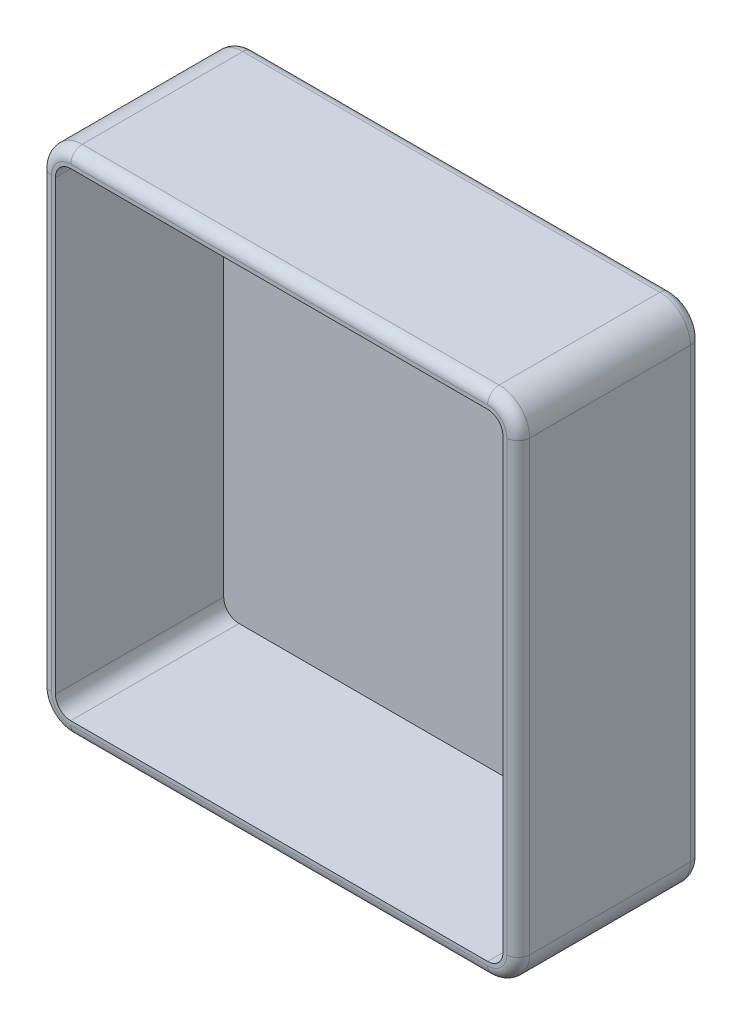
ISO-10303-21;
HEADER;
FILE_DESCRIPTION(('STEP AP214'),'2;1');
FILE_NAME('part.step','',(''),(''),'','','');
FILE_SCHEMA(('AUTOMOTIVE_DESIGN { 1 0 10303 214 1 1 1 1 }'));
ENDSEC;
DATA;
#1=APPLICATION_CONTEXT('core data for automotive mechanical design processes');
#2=APPLICATION_PROTOCOL_DEFINITION('international standard','automotive_design',2000,#1);
#3=PRODUCT_CONTEXT('',#1,'mechanical');
#4=PRODUCT('Part','Part','',(#3));
#5=PRODUCT_RELATED_PRODUCT_CATEGORY('part','',(#4));
#6=PRODUCT_DEFINITION_FORMATION('','',#4);
#7=PRODUCT_DEFINITION_CONTEXT('part definition',#1,'design');
#8=PRODUCT_DEFINITION('design','',#6,#7);
#9=PRODUCT_DEFINITION_SHAPE('','',#8);
#10=(LENGTH_UNIT() NAMED_UNIT(*) SI_UNIT(.MILLI.,.METRE.));
#11=(NAMED_UNIT(*) PLANE_ANGLE_UNIT() SI_UNIT($,.RADIAN.));
#12=(NAMED_UNIT(*) SI_UNIT($,.STERADIAN.) SOLID_ANGLE_UNIT());
#13=UNCERTAINTY_MEASURE_WITH_UNIT(LENGTH_MEASURE(1.E-05),#10,'distance_accuracy_value','');
#14=(GEOMETRIC_REPRESENTATION_CONTEXT(3) GLOBAL_UNCERTAINTY_ASSIGNED_CONTEXT((#13)) GLOBAL_UNIT_ASSIGNED_CONTEXT((#10,
#11,#12)) REPRESENTATION_CONTEXT('',''));
#15=CARTESIAN_POINT('',(0.,0.,0.));
#16=DIRECTION('',(0.,0.,1.));
#17=DIRECTION('',(1.,0.,0.));
#18=AXIS2_PLACEMENT_3D('',#15,#16,#17);
#19=CARTESIAN_POINT('',(56.5,2.,22.));
#20=DIRECTION('',(0.,0.,-1.));
#21=DIRECTION('',(-1.,0.,0.));
#22=AXIS2_PLACEMENT_3D('',#19,#20,#21);
#23=CYLINDRICAL_SURFACE('',#22,4.);
#24=DIRECTION('',(0.,0.,-1.));
#25=VECTOR('',#24,1.);
#26=CARTESIAN_POINT('',(56.5,-2.,22.));
#27=LINE('',#26,#25);
#28=CARTESIAN_POINT('',(56.5,-2.,20.5));
#29=VERTEX_POINT('',#28);
#30=CARTESIAN_POINT('',(56.5,-2.,-0.5));
#31=VERTEX_POINT('',#30);
#32=EDGE_CURVE('E219',#29,#31,#27,.T.);
#33=ORIENTED_EDGE('',*,*,#32,.T.);
#34=CARTESIAN_POINT('',(56.5,2.,-0.5));
#35=DIRECTION('',(0.,0.,1.));
#36=DIRECTION('',(1.,0.,0.));
#37=AXIS2_PLACEMENT_3D('',#34,#35,#36);
#38=CIRCLE('',#37,4.);
#39=CARTESIAN_POINT('',(60.5,2.,-0.5));
#40=VERTEX_POINT('',#39);
#41=EDGE_CURVE('E45',#31,#40,#38,.T.);
#42=ORIENTED_EDGE('',*,*,#41,.T.);
#43=DIRECTION('',(0.,0.,1.));
#44=VECTOR('',#43,1.);
#45=CARTESIAN_POINT('',(60.5,2.,22.));
#46=LINE('',#45,#44);
#47=CARTESIAN_POINT('',(60.5,2.,20.5));
#48=VERTEX_POINT('',#47);
#49=EDGE_CURVE('E272',#48,#40,#46,.F.);
#50=ORIENTED_EDGE('',*,*,#49,.F.);
#51=CARTESIAN_POINT('',(56.5,2.,20.5));
#52=DIRECTION('',(0.,0.,1.));
#53=DIRECTION('',(1.,0.,0.));
#54=AXIS2_PLACEMENT_3D('',#51,#52,#53);
#55=CIRCLE('',#54,4.);
#56=EDGE_CURVE('E322',#48,#29,#55,.F.);
#57=ORIENTED_EDGE('',*,*,#56,.T.);
#58=EDGE_LOOP('',(#33,#42,#50,#57));
#59=FACE_BOUND('',#58,.T.);
#60=ADVANCED_FACE('F36',(#59),#23,.T.);
#61=CARTESIAN_POINT('',(60.5,2.,22.));
#62=DIRECTION('',(-1.,0.,0.));
#63=DIRECTION('',(0.,-1.,0.));
#64=AXIS2_PLACEMENT_3D('',#61,#62,#63);
#65=PLANE('',#64);
#66=ORIENTED_EDGE('',*,*,#49,.T.);
#67=DIRECTION('',(0.,1.,0.));
#68=VECTOR('',#67,1.);
#69=CARTESIAN_POINT('',(60.5,2.,-0.5));
#70=LINE('',#69,#68);
#71=CARTESIAN_POINT('',(60.5,60.5,-0.5));
#72=VERTEX_POINT('',#71);
#73=EDGE_CURVE('E375',#40,#72,#70,.T.);
#74=ORIENTED_EDGE('',*,*,#73,.T.);
#75=DIRECTION('',(0.,0.,-1.));
#76=VECTOR('',#75,1.);
#77=CARTESIAN_POINT('',(60.5,60.5,22.));
#78=LINE('',#77,#76);
#79=CARTESIAN_POINT('',(60.5,60.5,20.5));
#80=VERTEX_POINT('',#79);
#81=EDGE_CURVE('E275',#80,#72,#78,.T.);
#82=ORIENTED_EDGE('',*,*,#81,.F.);
#83=DIRECTION('',(0.,1.,0.));
#84=VECTOR('',#83,1.);
#85=CARTESIAN_POINT('',(60.5,2.,20.5));
#86=LINE('',#85,#84);
#87=EDGE_CURVE('E320',#80,#48,#86,.F.);
#88=ORIENTED_EDGE('',*,*,#87,.T.);
#89=EDGE_LOOP('',(#66,#74,#82,#88));
#90=FACE_BOUND('',#89,.T.);
#91=ADVANCED_FACE('F479',(#90),#65,.F.);
#92=CARTESIAN_POINT('',(56.5,60.5,22.));
#93=DIRECTION('',(0.,0.,-1.));
#94=DIRECTION('',(-1.,0.,0.));
#95=AXIS2_PLACEMENT_3D('',#92,#93,#94);
#96=CYLINDRICAL_SURFACE('',#95,4.);
#97=ORIENTED_EDGE('',*,*,#81,.T.);
#98=CARTESIAN_POINT('',(56.5,60.5,-0.5));
#99=DIRECTION('',(0.,0.,1.));
#100=DIRECTION('',(1.,0.,0.));
#101=AXIS2_PLACEMENT_3D('',#98,#99,#100);
#102=CIRCLE('',#101,4.);
#103=CARTESIAN_POINT('',(56.5,64.5,-0.5));
#104=VERTEX_POINT('',#103);
#105=EDGE_CURVE('E373',#72,#104,#102,.T.);
#106=ORIENTED_EDGE('',*,*,#105,.T.);
#107=DIRECTION('',(0.,0.,-1.));
#108=VECTOR('',#107,1.);
#109=CARTESIAN_POINT('',(56.5,64.5,22.));
#110=LINE('',#109,#108);
#111=CARTESIAN_POINT('',(56.5,64.5,20.5));
#112=VERTEX_POINT('',#111);
#113=EDGE_CURVE('E280',#112,#104,#110,.T.);
#114=ORIENTED_EDGE('',*,*,#113,.F.);
#115=CARTESIAN_POINT('',(56.5,60.5,20.5));
#116=DIRECTION('',(0.,0.,1.));
#117=DIRECTION('',(1.,0.,0.));
#118=AXIS2_PLACEMENT_3D('',#115,#116,#117);
#119=CIRCLE('',#118,4.);
#120=EDGE_CURVE('E318',#112,#80,#119,.F.);
#121=ORIENTED_EDGE('',*,*,#120,.T.);
#122=EDGE_LOOP('',(#97,#106,#114,#121));
#123=FACE_BOUND('',#122,.T.);
#124=ADVANCED_FACE('F466',(#123),#96,.T.);
#125=CARTESIAN_POINT('',(2.,64.5,22.));
#126=DIRECTION('',(0.,-1.,0.));
#127=DIRECTION('',(0.,0.,-1.));
#128=AXIS2_PLACEMENT_3D('',#125,#126,#127);
#129=PLANE('',#128);
#130=ORIENTED_EDGE('',*,*,#113,.T.);
#131=DIRECTION('',(-1.,0.,0.));
#132=VECTOR('',#131,1.);
#133=CARTESIAN_POINT('',(2.,64.5,-0.5));
#134=LINE('',#133,#132);
#135=CARTESIAN_POINT('',(2.,64.5,-0.5));
#136=VERTEX_POINT('',#135);
#137=EDGE_CURVE('E371',#104,#136,#134,.T.);
#138=ORIENTED_EDGE('',*,*,#137,.T.);
#139=DIRECTION('',(0.,0.,-1.));
#140=VECTOR('',#139,1.);
#141=CARTESIAN_POINT('',(2.,64.5,22.));
#142=LINE('',#141,#140);
#143=CARTESIAN_POINT('',(2.,64.5,20.5));
#144=VERTEX_POINT('',#143);
#145=EDGE_CURVE('E283',#144,#136,#142,.T.);
#146=ORIENTED_EDGE('',*,*,#145,.F.);
#147=DIRECTION('',(-1.,0.,0.));
#148=VECTOR('',#147,1.);
#149=CARTESIAN_POINT('',(56.5,64.5,20.5));
#150=LINE('',#149,#148);
#151=EDGE_CURVE('E316',#144,#112,#150,.F.);
#152=ORIENTED_EDGE('',*,*,#151,.T.);
#153=EDGE_LOOP('',(#130,#138,#146,#152));
#154=FACE_BOUND('',#153,.T.);
#155=ADVANCED_FACE('F463',(#154),#129,.F.);
#156=CARTESIAN_POINT('',(2.,60.5,22.));
#157=DIRECTION('',(0.,0.,-1.));
#158=DIRECTION('',(-1.,0.,0.));
#159=AXIS2_PLACEMENT_3D('',#156,#157,#158);
#160=CYLINDRICAL_SURFACE('',#159,4.);
#161=ORIENTED_EDGE('',*,*,#145,.T.);
#162=CARTESIAN_POINT('',(2.,60.5,-0.5));
#163=DIRECTION('',(0.,0.,1.));
#164=DIRECTION('',(1.,0.,0.));
#165=AXIS2_PLACEMENT_3D('',#162,#163,#164);
#166=CIRCLE('',#165,4.);
#167=CARTESIAN_POINT('',(-2.,60.5,-0.5));
#168=VERTEX_POINT('',#167);
#169=EDGE_CURVE('E369',#136,#168,#166,.T.);
#170=ORIENTED_EDGE('',*,*,#169,.T.);
#171=DIRECTION('',(0.,0.,1.));
#172=VECTOR('',#171,1.);
#173=CARTESIAN_POINT('',(-2.,60.5,22.));
#174=LINE('',#173,#172);
#175=CARTESIAN_POINT('',(-2.,60.5,20.5));
#176=VERTEX_POINT('',#175);
#177=EDGE_CURVE('E286',#176,#168,#174,.F.);
#178=ORIENTED_EDGE('',*,*,#177,.F.);
#179=CARTESIAN_POINT('',(2.,60.5,20.5));
#180=DIRECTION('',(0.,0.,1.));
#181=DIRECTION('',(1.,0.,0.));
#182=AXIS2_PLACEMENT_3D('',#179,#180,#181);
#183=CIRCLE('',#182,4.);
#184=EDGE_CURVE('E314',#176,#144,#183,.F.);
#185=ORIENTED_EDGE('',*,*,#184,.T.);
#186=EDGE_LOOP('',(#161,#170,#178,#185));
#187=FACE_BOUND('',#186,.T.);
#188=ADVANCED_FACE('F451',(#187),#160,.T.);
#189=CARTESIAN_POINT('',(-2.,2.00000000000001,22.));
#190=DIRECTION('',(1.,0.,0.));
#191=DIRECTION('',(0.,1.,0.));
#192=AXIS2_PLACEMENT_3D('',#189,#190,#191);
#193=PLANE('',#192);
#194=ORIENTED_EDGE('',*,*,#177,.T.);
#195=DIRECTION('',(0.,-1.,0.));
#196=VECTOR('',#195,1.);
#197=CARTESIAN_POINT('',(-2.,2.00000000000001,-0.5));
#198=LINE('',#197,#196);
#199=CARTESIAN_POINT('',(-2.,2.,-0.5));
#200=VERTEX_POINT('',#199);
#201=EDGE_CURVE('E367',#168,#200,#198,.T.);
#202=ORIENTED_EDGE('',*,*,#201,.T.);
#203=DIRECTION('',(0.,0.,-1.));
#204=VECTOR('',#203,1.);
#205=CARTESIAN_POINT('',(-2.,2.,22.));
#206=LINE('',#205,#204);
#207=CARTESIAN_POINT('',(-2.,2.,20.5));
#208=VERTEX_POINT('',#207);
#209=EDGE_CURVE('E289',#208,#200,#206,.T.);
#210=ORIENTED_EDGE('',*,*,#209,.F.);
#211=DIRECTION('',(0.,-1.,0.));
#212=VECTOR('',#211,1.);
#213=CARTESIAN_POINT('',(-2.,60.5,20.5));
#214=LINE('',#213,#212);
#215=EDGE_CURVE('E312',#208,#176,#214,.F.);
#216=ORIENTED_EDGE('',*,*,#215,.T.);
#217=EDGE_LOOP('',(#194,#202,#210,#216));
#218=FACE_BOUND('',#217,.T.);
#219=ADVANCED_FACE('F425',(#218),#193,.F.);
#220=CARTESIAN_POINT('',(2.,2.,22.));
#221=DIRECTION('',(0.,0.,-1.));
#222=DIRECTION('',(-1.,0.,0.));
#223=AXIS2_PLACEMENT_3D('',#220,#221,#222);
#224=CYLINDRICAL_SURFACE('',#223,4.);
#225=ORIENTED_EDGE('',*,*,#209,.T.);
#226=CARTESIAN_POINT('',(2.,2.,-0.5));
#227=DIRECTION('',(0.,0.,1.));
#228=DIRECTION('',(1.,0.,0.));
#229=AXIS2_PLACEMENT_3D('',#226,#227,#228);
#230=CIRCLE('',#229,4.);
#231=CARTESIAN_POINT('',(2.00000000000001,-2.,-0.5));
#232=VERTEX_POINT('',#231);
#233=EDGE_CURVE('E326',#200,#232,#230,.T.);
#234=ORIENTED_EDGE('',*,*,#233,.T.);
#235=DIRECTION('',(0.,0.,1.));
#236=VECTOR('',#235,1.);
#237=CARTESIAN_POINT('',(2.00000000000001,-2.,22.));
#238=LINE('',#237,#236);
#239=CARTESIAN_POINT('',(2.00000000000001,-2.,20.5));
#240=VERTEX_POINT('',#239);
#241=EDGE_CURVE('E277',#240,#232,#238,.F.);
#242=ORIENTED_EDGE('',*,*,#241,.F.);
#243=CARTESIAN_POINT('',(2.,2.,20.5));
#244=DIRECTION('',(0.,0.,1.));
#245=DIRECTION('',(1.,0.,0.));
#246=AXIS2_PLACEMENT_3D('',#243,#244,#245);
#247=CIRCLE('',#246,4.);
#248=EDGE_CURVE('E309',#240,#208,#247,.F.);
#249=ORIENTED_EDGE('',*,*,#248,.T.);
#250=EDGE_LOOP('',(#225,#234,#242,#249));
#251=FACE_BOUND('',#250,.T.);
#252=ADVANCED_FACE('F428',(#251),#224,.T.);
#253=CARTESIAN_POINT('',(2.00000000000001,-2.,22.));
#254=DIRECTION('',(0.,1.,0.));
#255=DIRECTION('',(0.,0.,1.));
#256=AXIS2_PLACEMENT_3D('',#253,#254,#255);
#257=PLANE('',#256);
#258=ORIENTED_EDGE('',*,*,#241,.T.);
#259=DIRECTION('',(1.,0.,0.));
#260=VECTOR('',#259,1.);
#261=CARTESIAN_POINT('',(2.00000000000001,-2.,-0.5));
#262=LINE('',#261,#260);
#263=EDGE_CURVE('E11',#232,#31,#262,.T.);
#264=ORIENTED_EDGE('',*,*,#263,.T.);
#265=ORIENTED_EDGE('',*,*,#32,.F.);
#266=DIRECTION('',(1.,0.,0.));
#267=VECTOR('',#266,1.);
#268=CARTESIAN_POINT('',(2.00000000000003,-2.,20.5));
#269=LINE('',#268,#267);
#270=EDGE_CURVE('E324',#29,#240,#269,.F.);
#271=ORIENTED_EDGE('',*,*,#270,.T.);
#272=EDGE_LOOP('',(#258,#264,#265,#271));
#273=FACE_BOUND('',#272,.T.);
#274=ADVANCED_FACE('F481',(#273),#257,.F.);
#275=CARTESIAN_POINT('',(56.5,2.,22.));
#276=DIRECTION('',(0.,0.,1.));
#277=DIRECTION('',(1.,0.,0.));
#278=AXIS2_PLACEMENT_3D('',#275,#276,#277);
#279=PLANE('',#278);
#280=DIRECTION('',(0.,-1.,0.));
#281=VECTOR('',#280,1.);
#282=CARTESIAN_POINT('',(-0.5,2.,22.));
#283=LINE('',#282,#281);
#284=CARTESIAN_POINT('',(-0.5,60.5,22.));
#285=VERTEX_POINT('',#284);
#286=CARTESIAN_POINT('',(-0.5,2.,22.));
#287=VERTEX_POINT('',#286);
#288=EDGE_CURVE('E304',#285,#287,#283,.T.);
#289=ORIENTED_EDGE('',*,*,#288,.T.);
#290=CARTESIAN_POINT('',(2.,2.,22.));
#291=DIRECTION('',(0.,0.,1.));
#292=DIRECTION('',(1.,0.,0.));
#293=AXIS2_PLACEMENT_3D('',#290,#291,#292);
#294=CIRCLE('',#293,2.5);
#295=CARTESIAN_POINT('',(2.00000000000001,-0.5,22.));
#296=VERTEX_POINT('',#295);
#297=EDGE_CURVE('E306',#287,#296,#294,.T.);
#298=ORIENTED_EDGE('',*,*,#297,.T.);
#299=DIRECTION('',(1.,0.,0.));
#300=VECTOR('',#299,1.);
#301=CARTESIAN_POINT('',(56.5,-0.5,22.));
#302=LINE('',#301,#300);
#303=CARTESIAN_POINT('',(56.5,-0.5,22.));
#304=VERTEX_POINT('',#303);
#305=EDGE_CURVE('E274',#296,#304,#302,.T.);
#306=ORIENTED_EDGE('',*,*,#305,.T.);
#307=CARTESIAN_POINT('',(56.5,2.,22.));
#308=DIRECTION('',(0.,0.,1.));
#309=DIRECTION('',(1.,0.,0.));
#310=AXIS2_PLACEMENT_3D('',#307,#308,#309);
#311=CIRCLE('',#310,2.5);
#312=CARTESIAN_POINT('',(59.,2.,22.));
#313=VERTEX_POINT('',#312);
#314=EDGE_CURVE('E294',#304,#313,#311,.T.);
#315=ORIENTED_EDGE('',*,*,#314,.T.);
#316=DIRECTION('',(0.,1.,0.));
#317=VECTOR('',#316,1.);
#318=CARTESIAN_POINT('',(59.,60.5,22.));
#319=LINE('',#318,#317);
#320=CARTESIAN_POINT('',(59.,60.5,22.));
#321=VERTEX_POINT('',#320);
#322=EDGE_CURVE('E296',#313,#321,#319,.T.);
#323=ORIENTED_EDGE('',*,*,#322,.T.);
#324=CARTESIAN_POINT('',(56.5,60.5,22.));
#325=DIRECTION('',(0.,0.,1.));
#326=DIRECTION('',(1.,0.,0.));
#327=AXIS2_PLACEMENT_3D('',#324,#325,#326);
#328=CIRCLE('',#327,2.5);
#329=CARTESIAN_POINT('',(56.5,63.,22.));
#330=VERTEX_POINT('',#329);
#331=EDGE_CURVE('E298',#321,#330,#328,.T.);
#332=ORIENTED_EDGE('',*,*,#331,.T.);
#333=DIRECTION('',(-1.,0.,0.));
#334=VECTOR('',#333,1.);
#335=CARTESIAN_POINT('',(2.,63.,22.));
#336=LINE('',#335,#334);
#337=CARTESIAN_POINT('',(2.,63.,22.));
#338=VERTEX_POINT('',#337);
#339=EDGE_CURVE('E300',#330,#338,#336,.T.);
#340=ORIENTED_EDGE('',*,*,#339,.T.);
#341=CARTESIAN_POINT('',(2.,60.5,22.));
#342=DIRECTION('',(0.,0.,1.));
#343=DIRECTION('',(1.,0.,0.));
#344=AXIS2_PLACEMENT_3D('',#341,#342,#343);
#345=CIRCLE('',#344,2.5);
#346=EDGE_CURVE('E302',#338,#285,#345,.T.);
#347=ORIENTED_EDGE('',*,*,#346,.T.);
#348=EDGE_LOOP('',(#289,#298,#306,#315,#323,#332,#340,#347));
#349=FACE_BOUND('',#348,.T.);
#350=CARTESIAN_POINT('',(56.5,2.,22.));
#351=DIRECTION('',(0.,0.,1.));
#352=DIRECTION('',(1.,0.,0.));
#353=AXIS2_PLACEMENT_3D('',#350,#351,#352);
#354=CIRCLE('',#353,2.);
#355=CARTESIAN_POINT('',(56.5,0.,22.));
#356=VERTEX_POINT('',#355);
#357=CARTESIAN_POINT('',(58.5,2.,22.));
#358=VERTEX_POINT('',#357);
#359=EDGE_CURVE('E200',#356,#358,#354,.T.);
#360=ORIENTED_EDGE('',*,*,#359,.F.);
#361=DIRECTION('',(1.,0.,0.));
#362=VECTOR('',#361,1.);
#363=CARTESIAN_POINT('',(2.00000000000001,0.,22.));
#364=LINE('',#363,#362);
#365=CARTESIAN_POINT('',(2.00000000000001,0.,22.));
#366=VERTEX_POINT('',#365);
#367=EDGE_CURVE('E238',#366,#356,#364,.T.);
#368=ORIENTED_EDGE('',*,*,#367,.F.);
#369=CARTESIAN_POINT('',(2.,2.,22.));
#370=DIRECTION('',(0.,0.,1.));
#371=DIRECTION('',(-1.,0.,0.));
#372=AXIS2_PLACEMENT_3D('',#369,#370,#371);
#373=CIRCLE('',#372,2.);
#374=CARTESIAN_POINT('',(0.,2.,22.));
#375=VERTEX_POINT('',#374);
#376=EDGE_CURVE('E235',#375,#366,#373,.T.);
#377=ORIENTED_EDGE('',*,*,#376,.F.);
#378=DIRECTION('',(0.,-1.,0.));
#379=VECTOR('',#378,1.);
#380=CARTESIAN_POINT('',(0.,2.00000000000001,22.));
#381=LINE('',#380,#379);
#382=CARTESIAN_POINT('',(0.,60.5,22.));
#383=VERTEX_POINT('',#382);
#384=EDGE_CURVE('E233',#383,#375,#381,.T.);
#385=ORIENTED_EDGE('',*,*,#384,.F.);
#386=CARTESIAN_POINT('',(2.,60.5,22.));
#387=DIRECTION('',(0.,0.,1.));
#388=DIRECTION('',(-1.,0.,0.));
#389=AXIS2_PLACEMENT_3D('',#386,#387,#388);
#390=CIRCLE('',#389,2.);
#391=CARTESIAN_POINT('',(2.,62.5,22.));
#392=VERTEX_POINT('',#391);
#393=EDGE_CURVE('E231',#392,#383,#390,.T.);
#394=ORIENTED_EDGE('',*,*,#393,.F.);
#395=DIRECTION('',(-1.,0.,0.));
#396=VECTOR('',#395,1.);
#397=CARTESIAN_POINT('',(2.,62.5,22.));
#398=LINE('',#397,#396);
#399=CARTESIAN_POINT('',(56.5,62.5,22.));
#400=VERTEX_POINT('',#399);
#401=EDGE_CURVE('E227',#400,#392,#398,.T.);
#402=ORIENTED_EDGE('',*,*,#401,.F.);
#403=CARTESIAN_POINT('',(56.5,60.5,22.));
#404=DIRECTION('',(0.,0.,1.));
#405=DIRECTION('',(-1.,0.,0.));
#406=AXIS2_PLACEMENT_3D('',#403,#404,#405);
#407=CIRCLE('',#406,2.);
#408=CARTESIAN_POINT('',(58.5,60.5,22.));
#409=VERTEX_POINT('',#408);
#410=EDGE_CURVE('E225',#409,#400,#407,.T.);
#411=ORIENTED_EDGE('',*,*,#410,.F.);
#412=DIRECTION('',(0.,1.,0.));
#413=VECTOR('',#412,1.);
#414=CARTESIAN_POINT('',(58.5,2.,22.));
#415=LINE('',#414,#413);
#416=EDGE_CURVE('E211',#358,#409,#415,.T.);
#417=ORIENTED_EDGE('',*,*,#416,.F.);
#418=EDGE_LOOP('',(#360,#368,#377,#385,#394,#402,#411,#417));
#419=FACE_BOUND('',#418,.T.);
#420=ADVANCED_FACE('F223',(#349,#419),#279,.T.);
#421=CARTESIAN_POINT('',(56.5,2.,-2.));
#422=DIRECTION('',(0.,0.,1.));
#423=DIRECTION('',(1.,0.,0.));
#424=AXIS2_PLACEMENT_3D('',#421,#422,#423);
#425=PLANE('',#424);
#426=DIRECTION('',(1.,0.,0.));
#427=VECTOR('',#426,1.);
#428=CARTESIAN_POINT('',(56.5,-0.5,-2.));
#429=LINE('',#428,#427);
#430=CARTESIAN_POINT('',(56.5,-0.5,-2.));
#431=VERTEX_POINT('',#430);
#432=CARTESIAN_POINT('',(2.00000000000001,-0.5,-2.));
#433=VERTEX_POINT('',#432);
#434=EDGE_CURVE('E350',#431,#433,#429,.F.);
#435=ORIENTED_EDGE('',*,*,#434,.T.);
#436=CARTESIAN_POINT('',(2.,2.,-2.));
#437=DIRECTION('',(0.,0.,1.));
#438=DIRECTION('',(1.,0.,0.));
#439=AXIS2_PLACEMENT_3D('',#436,#437,#438);
#440=CIRCLE('',#439,2.5);
#441=CARTESIAN_POINT('',(-0.5,2.,-2.));
#442=VERTEX_POINT('',#441);
#443=EDGE_CURVE('E364',#433,#442,#440,.F.);
#444=ORIENTED_EDGE('',*,*,#443,.T.);
#445=DIRECTION('',(0.,-1.,0.));
#446=VECTOR('',#445,1.);
#447=CARTESIAN_POINT('',(-0.5,2.,-2.));
#448=LINE('',#447,#446);
#449=CARTESIAN_POINT('',(-0.5,60.5,-2.));
#450=VERTEX_POINT('',#449);
#451=EDGE_CURVE('E362',#442,#450,#448,.F.);
#452=ORIENTED_EDGE('',*,*,#451,.T.);
#453=CARTESIAN_POINT('',(2.,60.5,-2.));
#454=DIRECTION('',(0.,0.,1.));
#455=DIRECTION('',(1.,0.,0.));
#456=AXIS2_PLACEMENT_3D('',#453,#454,#455);
#457=CIRCLE('',#456,2.5);
#458=CARTESIAN_POINT('',(2.,63.,-2.));
#459=VERTEX_POINT('',#458);
#460=EDGE_CURVE('E360',#450,#459,#457,.F.);
#461=ORIENTED_EDGE('',*,*,#460,.T.);
#462=DIRECTION('',(-1.,0.,0.));
#463=VECTOR('',#462,1.);
#464=CARTESIAN_POINT('',(56.5,63.,-2.));
#465=LINE('',#464,#463);
#466=CARTESIAN_POINT('',(56.5,63.,-2.));
#467=VERTEX_POINT('',#466);
#468=EDGE_CURVE('E358',#459,#467,#465,.F.);
#469=ORIENTED_EDGE('',*,*,#468,.T.);
#470=CARTESIAN_POINT('',(56.5,60.5,-2.));
#471=DIRECTION('',(0.,0.,1.));
#472=DIRECTION('',(1.,0.,0.));
#473=AXIS2_PLACEMENT_3D('',#470,#471,#472);
#474=CIRCLE('',#473,2.5);
#475=CARTESIAN_POINT('',(59.,60.5,-2.));
#476=VERTEX_POINT('',#475);
#477=EDGE_CURVE('E356',#467,#476,#474,.F.);
#478=ORIENTED_EDGE('',*,*,#477,.T.);
#479=DIRECTION('',(0.,1.,0.));
#480=VECTOR('',#479,1.);
#481=CARTESIAN_POINT('',(59.,2.,-2.));
#482=LINE('',#481,#480);
#483=CARTESIAN_POINT('',(59.,2.,-2.));
#484=VERTEX_POINT('',#483);
#485=EDGE_CURVE('E354',#476,#484,#482,.F.);
#486=ORIENTED_EDGE('',*,*,#485,.T.);
#487=CARTESIAN_POINT('',(56.5,2.,-2.));
#488=DIRECTION('',(0.,0.,1.));
#489=DIRECTION('',(1.,0.,0.));
#490=AXIS2_PLACEMENT_3D('',#487,#488,#489);
#491=CIRCLE('',#490,2.5);
#492=EDGE_CURVE('E352',#484,#431,#491,.F.);
#493=ORIENTED_EDGE('',*,*,#492,.T.);
#494=EDGE_LOOP('',(#435,#444,#452,#461,#469,#478,#486,#493));
#495=FACE_BOUND('',#494,.T.);
#496=ADVANCED_FACE('F410',(#495),#425,.F.);
#497=CARTESIAN_POINT('',(56.5,2.,22.));
#498=DIRECTION('',(0.,0.,-1.));
#499=DIRECTION('',(-1.,0.,0.));
#500=AXIS2_PLACEMENT_3D('',#497,#498,#499);
#501=CYLINDRICAL_SURFACE('',#500,2.);
#502=CARTESIAN_POINT('',(56.5,2.,0.));
#503=DIRECTION('',(0.,0.,1.));
#504=DIRECTION('',(1.,0.,0.));
#505=AXIS2_PLACEMENT_3D('',#502,#503,#504);
#506=CIRCLE('',#505,2.);
#507=CARTESIAN_POINT('',(56.5,0.,0.));
#508=VERTEX_POINT('',#507);
#509=CARTESIAN_POINT('',(58.5,2.,0.));
#510=VERTEX_POINT('',#509);
#511=EDGE_CURVE('E240',#508,#510,#506,.T.);
#512=ORIENTED_EDGE('',*,*,#511,.F.);
#513=DIRECTION('',(0.,0.,-1.));
#514=VECTOR('',#513,1.);
#515=CARTESIAN_POINT('',(56.5,0.,22.));
#516=LINE('',#515,#514);
#517=EDGE_CURVE('E207',#356,#508,#516,.T.);
#518=ORIENTED_EDGE('',*,*,#517,.F.);
#519=ORIENTED_EDGE('',*,*,#359,.T.);
#520=DIRECTION('',(0.,0.,-1.));
#521=VECTOR('',#520,1.);
#522=CARTESIAN_POINT('',(58.5,2.,22.));
#523=LINE('',#522,#521);
#524=EDGE_CURVE('E204',#358,#510,#523,.T.);
#525=ORIENTED_EDGE('',*,*,#524,.T.);
#526=EDGE_LOOP('',(#512,#518,#519,#525));
#527=FACE_BOUND('',#526,.T.);
#528=ADVANCED_FACE('F203',(#527),#501,.F.);
#529=CARTESIAN_POINT('',(58.5,2.,22.));
#530=DIRECTION('',(-1.,0.,0.));
#531=DIRECTION('',(0.,-1.,0.));
#532=AXIS2_PLACEMENT_3D('',#529,#530,#531);
#533=PLANE('',#532);
#534=DIRECTION('',(0.,1.,0.));
#535=VECTOR('',#534,1.);
#536=CARTESIAN_POINT('',(58.5,2.,0.));
#537=LINE('',#536,#535);
#538=CARTESIAN_POINT('',(58.5,60.5,0.));
#539=VERTEX_POINT('',#538);
#540=EDGE_CURVE('E218',#510,#539,#537,.T.);
#541=ORIENTED_EDGE('',*,*,#540,.F.);
#542=ORIENTED_EDGE('',*,*,#524,.F.);
#543=ORIENTED_EDGE('',*,*,#416,.T.);
#544=DIRECTION('',(0.,0.,-1.));
#545=VECTOR('',#544,1.);
#546=CARTESIAN_POINT('',(58.5,60.5,22.));
#547=LINE('',#546,#545);
#548=EDGE_CURVE('E220',#409,#539,#547,.T.);
#549=ORIENTED_EDGE('',*,*,#548,.T.);
#550=EDGE_LOOP('',(#541,#542,#543,#549));
#551=FACE_BOUND('',#550,.T.);
#552=ADVANCED_FACE('F215',(#551),#533,.T.);
#553=CARTESIAN_POINT('',(56.5,60.5,22.));
#554=DIRECTION('',(0.,0.,-1.));
#555=DIRECTION('',(-1.,0.,0.));
#556=AXIS2_PLACEMENT_3D('',#553,#554,#555);
#557=CYLINDRICAL_SURFACE('',#556,2.);
#558=CARTESIAN_POINT('',(56.5,60.5,0.));
#559=DIRECTION('',(0.,0.,1.));
#560=DIRECTION('',(-1.,0.,0.));
#561=AXIS2_PLACEMENT_3D('',#558,#559,#560);
#562=CIRCLE('',#561,2.);
#563=CARTESIAN_POINT('',(56.5,62.5,0.));
#564=VERTEX_POINT('',#563);
#565=EDGE_CURVE('E244',#539,#564,#562,.T.);
#566=ORIENTED_EDGE('',*,*,#565,.F.);
#567=ORIENTED_EDGE('',*,*,#548,.F.);
#568=ORIENTED_EDGE('',*,*,#410,.T.);
#569=DIRECTION('',(0.,0.,-1.));
#570=VECTOR('',#569,1.);
#571=CARTESIAN_POINT('',(56.5,62.5,22.));
#572=LINE('',#571,#570);
#573=EDGE_CURVE('E268',#400,#564,#572,.T.);
#574=ORIENTED_EDGE('',*,*,#573,.T.);
#575=EDGE_LOOP('',(#566,#567,#568,#574));
#576=FACE_BOUND('',#575,.T.);
#577=ADVANCED_FACE('F731',(#576),#557,.F.);
#578=CARTESIAN_POINT('',(2.,62.5,22.));
#579=DIRECTION('',(0.,-1.,0.));
#580=DIRECTION('',(0.,0.,-1.));
#581=AXIS2_PLACEMENT_3D('',#578,#579,#580);
#582=PLANE('',#581);
#583=DIRECTION('',(-1.,0.,0.));
#584=VECTOR('',#583,1.);
#585=CARTESIAN_POINT('',(2.,62.5,0.));
#586=LINE('',#585,#584);
#587=CARTESIAN_POINT('',(2.,62.5,0.));
#588=VERTEX_POINT('',#587);
#589=EDGE_CURVE('E246',#564,#588,#586,.T.);
#590=ORIENTED_EDGE('',*,*,#589,.F.);
#591=ORIENTED_EDGE('',*,*,#573,.F.);
#592=ORIENTED_EDGE('',*,*,#401,.T.);
#593=DIRECTION('',(0.,0.,-1.));
#594=VECTOR('',#593,1.);
#595=CARTESIAN_POINT('',(2.,62.5,22.));
#596=LINE('',#595,#594);
#597=EDGE_CURVE('E265',#392,#588,#596,.T.);
#598=ORIENTED_EDGE('',*,*,#597,.T.);
#599=EDGE_LOOP('',(#590,#591,#592,#598));
#600=FACE_BOUND('',#599,.T.);
#601=ADVANCED_FACE('F722',(#600),#582,.T.);
#602=CARTESIAN_POINT('',(2.,60.5,22.));
#603=DIRECTION('',(0.,0.,-1.));
#604=DIRECTION('',(-1.,0.,0.));
#605=AXIS2_PLACEMENT_3D('',#602,#603,#604);
#606=CYLINDRICAL_SURFACE('',#605,2.);
#607=CARTESIAN_POINT('',(2.,60.5,0.));
#608=DIRECTION('',(0.,0.,1.));
#609=DIRECTION('',(-1.,0.,0.));
#610=AXIS2_PLACEMENT_3D('',#607,#608,#609);
#611=CIRCLE('',#610,2.);
#612=CARTESIAN_POINT('',(0.,60.5,0.));
#613=VERTEX_POINT('',#612);
#614=EDGE_CURVE('E248',#588,#613,#611,.T.);
#615=ORIENTED_EDGE('',*,*,#614,.F.);
#616=ORIENTED_EDGE('',*,*,#597,.F.);
#617=ORIENTED_EDGE('',*,*,#393,.T.);
#618=DIRECTION('',(0.,0.,-1.));
#619=VECTOR('',#618,1.);
#620=CARTESIAN_POINT('',(0.,60.5,22.));
#621=LINE('',#620,#619);
#622=EDGE_CURVE('E262',#383,#613,#621,.T.);
#623=ORIENTED_EDGE('',*,*,#622,.T.);
#624=EDGE_LOOP('',(#615,#616,#617,#623));
#625=FACE_BOUND('',#624,.T.);
#626=ADVANCED_FACE('F713',(#625),#606,.F.);
#627=CARTESIAN_POINT('',(0.,2.00000000000001,22.));
#628=DIRECTION('',(1.,0.,0.));
#629=DIRECTION('',(0.,1.,0.));
#630=AXIS2_PLACEMENT_3D('',#627,#628,#629);
#631=PLANE('',#630);
#632=DIRECTION('',(0.,-1.,0.));
#633=VECTOR('',#632,1.);
#634=CARTESIAN_POINT('',(0.,2.00000000000001,0.));
#635=LINE('',#634,#633);
#636=CARTESIAN_POINT('',(0.,2.,0.));
#637=VERTEX_POINT('',#636);
#638=EDGE_CURVE('E250',#613,#637,#635,.T.);
#639=ORIENTED_EDGE('',*,*,#638,.F.);
#640=ORIENTED_EDGE('',*,*,#622,.F.);
#641=ORIENTED_EDGE('',*,*,#384,.T.);
#642=DIRECTION('',(0.,0.,-1.));
#643=VECTOR('',#642,1.);
#644=CARTESIAN_POINT('',(0.,2.,22.));
#645=LINE('',#644,#643);
#646=EDGE_CURVE('E259',#375,#637,#645,.T.);
#647=ORIENTED_EDGE('',*,*,#646,.T.);
#648=EDGE_LOOP('',(#639,#640,#641,#647));
#649=FACE_BOUND('',#648,.T.);
#650=ADVANCED_FACE('F704',(#649),#631,.T.);
#651=CARTESIAN_POINT('',(2.,2.,22.));
#652=DIRECTION('',(0.,0.,-1.));
#653=DIRECTION('',(-1.,0.,0.));
#654=AXIS2_PLACEMENT_3D('',#651,#652,#653);
#655=CYLINDRICAL_SURFACE('',#654,2.);
#656=CARTESIAN_POINT('',(2.,2.,0.));
#657=DIRECTION('',(0.,0.,1.));
#658=DIRECTION('',(-1.,0.,0.));
#659=AXIS2_PLACEMENT_3D('',#656,#657,#658);
#660=CIRCLE('',#659,2.);
#661=CARTESIAN_POINT('',(2.00000000000001,0.,0.));
#662=VERTEX_POINT('',#661);
#663=EDGE_CURVE('E252',#637,#662,#660,.T.);
#664=ORIENTED_EDGE('',*,*,#663,.F.);
#665=ORIENTED_EDGE('',*,*,#646,.F.);
#666=ORIENTED_EDGE('',*,*,#376,.T.);
#667=DIRECTION('',(0.,0.,-1.));
#668=VECTOR('',#667,1.);
#669=CARTESIAN_POINT('',(2.00000000000001,0.,22.));
#670=LINE('',#669,#668);
#671=EDGE_CURVE('E256',#366,#662,#670,.T.);
#672=ORIENTED_EDGE('',*,*,#671,.T.);
#673=EDGE_LOOP('',(#664,#665,#666,#672));
#674=FACE_BOUND('',#673,.T.);
#675=ADVANCED_FACE('F695',(#674),#655,.F.);
#676=CARTESIAN_POINT('',(2.00000000000001,0.,22.));
#677=DIRECTION('',(0.,1.,0.));
#678=DIRECTION('',(0.,0.,1.));
#679=AXIS2_PLACEMENT_3D('',#676,#677,#678);
#680=PLANE('',#679);
#681=DIRECTION('',(1.,0.,0.));
#682=VECTOR('',#681,1.);
#683=CARTESIAN_POINT('',(2.00000000000001,0.,0.));
#684=LINE('',#683,#682);
#685=EDGE_CURVE('E212',#662,#508,#684,.T.);
#686=ORIENTED_EDGE('',*,*,#685,.F.);
#687=ORIENTED_EDGE('',*,*,#671,.F.);
#688=ORIENTED_EDGE('',*,*,#367,.T.);
#689=ORIENTED_EDGE('',*,*,#517,.T.);
#690=EDGE_LOOP('',(#686,#687,#688,#689));
#691=FACE_BOUND('',#690,.T.);
#692=ADVANCED_FACE('F686',(#691),#680,.T.);
#693=CARTESIAN_POINT('',(56.5,2.,0.));
#694=DIRECTION('',(0.,0.,1.));
#695=DIRECTION('',(1.,0.,0.));
#696=AXIS2_PLACEMENT_3D('',#693,#694,#695);
#697=PLANE('',#696);
#698=ORIENTED_EDGE('',*,*,#511,.T.);
#699=ORIENTED_EDGE('',*,*,#540,.T.);
#700=ORIENTED_EDGE('',*,*,#565,.T.);
#701=ORIENTED_EDGE('',*,*,#589,.T.);
#702=ORIENTED_EDGE('',*,*,#614,.T.);
#703=ORIENTED_EDGE('',*,*,#638,.T.);
#704=ORIENTED_EDGE('',*,*,#663,.T.);
#705=ORIENTED_EDGE('',*,*,#685,.T.);
#706=EDGE_LOOP('',(#698,#699,#700,#701,#702,#703,#704,#705));
#707=FACE_BOUND('',#706,.T.);
#708=ADVANCED_FACE('F634',(#707),#697,.T.);
#709=CARTESIAN_POINT('',(56.5,60.5,20.5));
#710=DIRECTION('',(0.,0.,1.));
#711=DIRECTION('',(1.,0.,0.));
#712=AXIS2_PLACEMENT_3D('',#709,#710,#711);
#713=TOROIDAL_SURFACE('',#712,2.5,1.5);
#714=CARTESIAN_POINT('',(59.,60.5,20.5));
#715=DIRECTION('',(0.,-1.,0.));
#716=DIRECTION('',(0.,0.,-1.));
#717=AXIS2_PLACEMENT_3D('',#714,#715,#716);
#718=CIRCLE('',#717,1.5);
#719=EDGE_CURVE('E343',#80,#321,#718,.T.);
#720=ORIENTED_EDGE('',*,*,#719,.F.);
#721=ORIENTED_EDGE('',*,*,#120,.F.);
#722=CARTESIAN_POINT('',(56.5,63.,20.5));
#723=DIRECTION('',(-1.,0.,0.));
#724=DIRECTION('',(0.,0.,1.));
#725=AXIS2_PLACEMENT_3D('',#722,#723,#724);
#726=CIRCLE('',#725,1.5);
#727=EDGE_CURVE('E242',#330,#112,#726,.T.);
#728=ORIENTED_EDGE('',*,*,#727,.F.);
#729=ORIENTED_EDGE('',*,*,#331,.F.);
#730=EDGE_LOOP('',(#720,#721,#728,#729));
#731=FACE_BOUND('',#730,.T.);
#732=ADVANCED_FACE('F470',(#731),#713,.T.);
#733=CARTESIAN_POINT('',(56.5,63.,20.5));
#734=DIRECTION('',(1.,0.,0.));
#735=DIRECTION('',(0.,0.,-1.));
#736=AXIS2_PLACEMENT_3D('',#733,#734,#735);
#737=CYLINDRICAL_SURFACE('',#736,1.5);
#738=ORIENTED_EDGE('',*,*,#727,.T.);
#739=ORIENTED_EDGE('',*,*,#151,.F.);
#740=CARTESIAN_POINT('',(2.,63.,20.5));
#741=DIRECTION('',(-1.,0.,0.));
#742=DIRECTION('',(0.,0.,1.));
#743=AXIS2_PLACEMENT_3D('',#740,#741,#742);
#744=CIRCLE('',#743,1.5);
#745=EDGE_CURVE('E340',#338,#144,#744,.T.);
#746=ORIENTED_EDGE('',*,*,#745,.F.);
#747=ORIENTED_EDGE('',*,*,#339,.F.);
#748=EDGE_LOOP('',(#738,#739,#746,#747));
#749=FACE_BOUND('',#748,.T.);
#750=ADVANCED_FACE('F459',(#749),#737,.T.);
#751=CARTESIAN_POINT('',(59.,2.,20.5));
#752=DIRECTION('',(0.,-1.,0.));
#753=DIRECTION('',(1.,0.,0.));
#754=AXIS2_PLACEMENT_3D('',#751,#752,#753);
#755=CYLINDRICAL_SURFACE('',#754,1.5);
#756=ORIENTED_EDGE('',*,*,#719,.T.);
#757=ORIENTED_EDGE('',*,*,#322,.F.);
#758=CARTESIAN_POINT('',(59.,2.,20.5));
#759=DIRECTION('',(0.,-1.,0.));
#760=DIRECTION('',(1.,0.,0.));
#761=AXIS2_PLACEMENT_3D('',#758,#759,#760);
#762=CIRCLE('',#761,1.5);
#763=EDGE_CURVE('E337',#48,#313,#762,.T.);
#764=ORIENTED_EDGE('',*,*,#763,.F.);
#765=ORIENTED_EDGE('',*,*,#87,.F.);
#766=EDGE_LOOP('',(#756,#757,#764,#765));
#767=FACE_BOUND('',#766,.T.);
#768=ADVANCED_FACE('F476',(#767),#755,.T.);
#769=CARTESIAN_POINT('',(2.,60.5,20.5));
#770=DIRECTION('',(0.,0.,1.));
#771=DIRECTION('',(1.,0.,0.));
#772=AXIS2_PLACEMENT_3D('',#769,#770,#771);
#773=TOROIDAL_SURFACE('',#772,2.5,1.5);
#774=ORIENTED_EDGE('',*,*,#745,.T.);
#775=ORIENTED_EDGE('',*,*,#184,.F.);
#776=CARTESIAN_POINT('',(-0.5,60.5,20.5));
#777=DIRECTION('',(0.,-1.,0.));
#778=DIRECTION('',(0.,0.,-1.));
#779=AXIS2_PLACEMENT_3D('',#776,#777,#778);
#780=CIRCLE('',#779,1.5);
#781=EDGE_CURVE('E334',#285,#176,#780,.T.);
#782=ORIENTED_EDGE('',*,*,#781,.F.);
#783=ORIENTED_EDGE('',*,*,#346,.F.);
#784=EDGE_LOOP('',(#774,#775,#782,#783));
#785=FACE_BOUND('',#784,.T.);
#786=ADVANCED_FACE('F454',(#785),#773,.T.);
#787=CARTESIAN_POINT('',(56.5,2.,20.5));
#788=DIRECTION('',(0.,0.,1.));
#789=DIRECTION('',(1.,0.,0.));
#790=AXIS2_PLACEMENT_3D('',#787,#788,#789);
#791=TOROIDAL_SURFACE('',#790,2.5,1.5);
#792=ORIENTED_EDGE('',*,*,#763,.T.);
#793=ORIENTED_EDGE('',*,*,#314,.F.);
#794=CARTESIAN_POINT('',(56.5,-0.500000000000001,20.5));
#795=DIRECTION('',(-1.,0.,0.));
#796=DIRECTION('',(0.,0.,1.));
#797=AXIS2_PLACEMENT_3D('',#794,#795,#796);
#798=CIRCLE('',#797,1.5);
#799=EDGE_CURVE('E331',#29,#304,#798,.T.);
#800=ORIENTED_EDGE('',*,*,#799,.F.);
#801=ORIENTED_EDGE('',*,*,#56,.F.);
#802=EDGE_LOOP('',(#792,#793,#800,#801));
#803=FACE_BOUND('',#802,.T.);
#804=ADVANCED_FACE('F482',(#803),#791,.T.);
#805=CARTESIAN_POINT('',(-0.5,2.,20.5));
#806=DIRECTION('',(0.,1.,0.));
#807=DIRECTION('',(-1.,0.,0.));
#808=AXIS2_PLACEMENT_3D('',#805,#806,#807);
#809=CYLINDRICAL_SURFACE('',#808,1.5);
#810=ORIENTED_EDGE('',*,*,#781,.T.);
#811=ORIENTED_EDGE('',*,*,#215,.F.);
#812=CARTESIAN_POINT('',(-0.5,2.,20.5));
#813=DIRECTION('',(0.,-1.,0.));
#814=DIRECTION('',(0.,0.,-1.));
#815=AXIS2_PLACEMENT_3D('',#812,#813,#814);
#816=CIRCLE('',#815,1.5);
#817=EDGE_CURVE('E329',#287,#208,#816,.T.);
#818=ORIENTED_EDGE('',*,*,#817,.F.);
#819=ORIENTED_EDGE('',*,*,#288,.F.);
#820=EDGE_LOOP('',(#810,#811,#818,#819));
#821=FACE_BOUND('',#820,.T.);
#822=ADVANCED_FACE('F448',(#821),#809,.T.);
#823=CARTESIAN_POINT('',(56.5,-0.5,20.5));
#824=DIRECTION('',(-1.,0.,0.));
#825=DIRECTION('',(0.,0.,1.));
#826=AXIS2_PLACEMENT_3D('',#823,#824,#825);
#827=CYLINDRICAL_SURFACE('',#826,1.5);
#828=ORIENTED_EDGE('',*,*,#799,.T.);
#829=ORIENTED_EDGE('',*,*,#305,.F.);
#830=CARTESIAN_POINT('',(2.00000000000001,-0.5,20.5));
#831=DIRECTION('',(-1.,0.,0.));
#832=DIRECTION('',(0.,0.,1.));
#833=AXIS2_PLACEMENT_3D('',#830,#831,#832);
#834=CIRCLE('',#833,1.5);
#835=EDGE_CURVE('E327',#240,#296,#834,.T.);
#836=ORIENTED_EDGE('',*,*,#835,.F.);
#837=ORIENTED_EDGE('',*,*,#270,.F.);
#838=EDGE_LOOP('',(#828,#829,#836,#837));
#839=FACE_BOUND('',#838,.T.);
#840=ADVANCED_FACE('F440',(#839),#827,.T.);
#841=CARTESIAN_POINT('',(2.,2.,20.5));
#842=DIRECTION('',(0.,0.,1.));
#843=DIRECTION('',(1.,0.,0.));
#844=AXIS2_PLACEMENT_3D('',#841,#842,#843);
#845=TOROIDAL_SURFACE('',#844,2.5,1.5);
#846=ORIENTED_EDGE('',*,*,#817,.T.);
#847=ORIENTED_EDGE('',*,*,#248,.F.);
#848=ORIENTED_EDGE('',*,*,#835,.T.);
#849=ORIENTED_EDGE('',*,*,#297,.F.);
#850=EDGE_LOOP('',(#846,#847,#848,#849));
#851=FACE_BOUND('',#850,.T.);
#852=ADVANCED_FACE('F433',(#851),#845,.T.);
#853=CARTESIAN_POINT('',(56.5,60.5,-0.5));
#854=DIRECTION('',(0.,0.,1.));
#855=DIRECTION('',(1.,0.,0.));
#856=AXIS2_PLACEMENT_3D('',#853,#854,#855);
#857=TOROIDAL_SURFACE('',#856,2.5,1.5);
#858=CARTESIAN_POINT('',(59.,60.5,-0.5));
#859=DIRECTION('',(0.,-1.,0.));
#860=DIRECTION('',(0.,0.,-1.));
#861=AXIS2_PLACEMENT_3D('',#858,#859,#860);
#862=CIRCLE('',#861,1.5);
#863=EDGE_CURVE('E393',#476,#72,#862,.T.);
#864=ORIENTED_EDGE('',*,*,#863,.F.);
#865=ORIENTED_EDGE('',*,*,#477,.F.);
#866=CARTESIAN_POINT('',(56.5,63.,-0.5));
#867=DIRECTION('',(-1.,0.,0.));
#868=DIRECTION('',(0.,0.,1.));
#869=AXIS2_PLACEMENT_3D('',#866,#867,#868);
#870=CIRCLE('',#869,1.5);
#871=EDGE_CURVE('E40',#104,#467,#870,.T.);
#872=ORIENTED_EDGE('',*,*,#871,.F.);
#873=ORIENTED_EDGE('',*,*,#105,.F.);
#874=EDGE_LOOP('',(#864,#865,#872,#873));
#875=FACE_BOUND('',#874,.T.);
#876=ADVANCED_FACE('F38',(#875),#857,.T.);
#877=CARTESIAN_POINT('',(2.,63.,-0.5));
#878=DIRECTION('',(-1.,0.,0.));
#879=DIRECTION('',(0.,0.,1.));
#880=AXIS2_PLACEMENT_3D('',#877,#878,#879);
#881=CYLINDRICAL_SURFACE('',#880,1.5);
#882=ORIENTED_EDGE('',*,*,#871,.T.);
#883=ORIENTED_EDGE('',*,*,#468,.F.);
#884=CARTESIAN_POINT('',(2.,63.,-0.5));
#885=DIRECTION('',(-1.,0.,0.));
#886=DIRECTION('',(0.,0.,1.));
#887=AXIS2_PLACEMENT_3D('',#884,#885,#886);
#888=CIRCLE('',#887,1.5);
#889=EDGE_CURVE('E391',#136,#459,#888,.T.);
#890=ORIENTED_EDGE('',*,*,#889,.F.);
#891=ORIENTED_EDGE('',*,*,#137,.F.);
#892=EDGE_LOOP('',(#882,#883,#890,#891));
#893=FACE_BOUND('',#892,.T.);
#894=ADVANCED_FACE('F404',(#893),#881,.T.);
#895=CARTESIAN_POINT('',(59.,2.,-0.5));
#896=DIRECTION('',(0.,1.,0.));
#897=DIRECTION('',(-1.,0.,0.));
#898=AXIS2_PLACEMENT_3D('',#895,#896,#897);
#899=CYLINDRICAL_SURFACE('',#898,1.5);
#900=ORIENTED_EDGE('',*,*,#863,.T.);
#901=ORIENTED_EDGE('',*,*,#73,.F.);
#902=CARTESIAN_POINT('',(59.,2.,-0.5));
#903=DIRECTION('',(0.,-1.,0.));
#904=DIRECTION('',(1.,0.,0.));
#905=AXIS2_PLACEMENT_3D('',#902,#903,#904);
#906=CIRCLE('',#905,1.5);
#907=EDGE_CURVE('E388',#484,#40,#906,.T.);
#908=ORIENTED_EDGE('',*,*,#907,.F.);
#909=ORIENTED_EDGE('',*,*,#485,.F.);
#910=EDGE_LOOP('',(#900,#901,#908,#909));
#911=FACE_BOUND('',#910,.T.);
#912=ADVANCED_FACE('F537',(#911),#899,.T.);
#913=CARTESIAN_POINT('',(2.,60.5,-0.5));
#914=DIRECTION('',(0.,0.,1.));
#915=DIRECTION('',(1.,0.,0.));
#916=AXIS2_PLACEMENT_3D('',#913,#914,#915);
#917=TOROIDAL_SURFACE('',#916,2.5,1.5);
#918=ORIENTED_EDGE('',*,*,#889,.T.);
#919=ORIENTED_EDGE('',*,*,#460,.F.);
#920=CARTESIAN_POINT('',(-0.500000000000001,60.5,-0.5));
#921=DIRECTION('',(0.,-1.,0.));
#922=DIRECTION('',(0.,0.,-1.));
#923=AXIS2_PLACEMENT_3D('',#920,#921,#922);
#924=CIRCLE('',#923,1.5);
#925=EDGE_CURVE('E385',#168,#450,#924,.T.);
#926=ORIENTED_EDGE('',*,*,#925,.F.);
#927=ORIENTED_EDGE('',*,*,#169,.F.);
#928=EDGE_LOOP('',(#918,#919,#926,#927));
#929=FACE_BOUND('',#928,.T.);
#930=ADVANCED_FACE('F416',(#929),#917,.T.);
#931=CARTESIAN_POINT('',(56.5,2.,-0.5));
#932=DIRECTION('',(0.,0.,1.));
#933=DIRECTION('',(1.,0.,0.));
#934=AXIS2_PLACEMENT_3D('',#931,#932,#933);
#935=TOROIDAL_SURFACE('',#934,2.5,1.5);
#936=ORIENTED_EDGE('',*,*,#907,.T.);
#937=ORIENTED_EDGE('',*,*,#41,.F.);
#938=CARTESIAN_POINT('',(56.5,-0.500000000000001,-0.5));
#939=DIRECTION('',(-1.,0.,0.));
#940=DIRECTION('',(0.,0.,1.));
#941=AXIS2_PLACEMENT_3D('',#938,#939,#940);
#942=CIRCLE('',#941,1.5);
#943=EDGE_CURVE('E382',#431,#31,#942,.T.);
#944=ORIENTED_EDGE('',*,*,#943,.F.);
#945=ORIENTED_EDGE('',*,*,#492,.F.);
#946=EDGE_LOOP('',(#936,#937,#944,#945));
#947=FACE_BOUND('',#946,.T.);
#948=ADVANCED_FACE('F549',(#947),#935,.T.);
#949=CARTESIAN_POINT('',(-0.5,2.00000000000001,-0.5));
#950=DIRECTION('',(0.,-1.,0.));
#951=DIRECTION('',(1.,0.,0.));
#952=AXIS2_PLACEMENT_3D('',#949,#950,#951);
#953=CYLINDRICAL_SURFACE('',#952,1.5);
#954=ORIENTED_EDGE('',*,*,#925,.T.);
#955=ORIENTED_EDGE('',*,*,#451,.F.);
#956=CARTESIAN_POINT('',(-0.5,2.,-0.5));
#957=DIRECTION('',(0.,-1.,0.));
#958=DIRECTION('',(0.,0.,-1.));
#959=AXIS2_PLACEMENT_3D('',#956,#957,#958);
#960=CIRCLE('',#959,1.5);
#961=EDGE_CURVE('E380',#200,#442,#960,.T.);
#962=ORIENTED_EDGE('',*,*,#961,.F.);
#963=ORIENTED_EDGE('',*,*,#201,.F.);
#964=EDGE_LOOP('',(#954,#955,#962,#963));
#965=FACE_BOUND('',#964,.T.);
#966=ADVANCED_FACE('F420',(#965),#953,.T.);
#967=CARTESIAN_POINT('',(2.00000000000001,-0.5,-0.5));
#968=DIRECTION('',(1.,0.,0.));
#969=DIRECTION('',(0.,0.,-1.));
#970=AXIS2_PLACEMENT_3D('',#967,#968,#969);
#971=CYLINDRICAL_SURFACE('',#970,1.5);
#972=ORIENTED_EDGE('',*,*,#943,.T.);
#973=ORIENTED_EDGE('',*,*,#263,.F.);
#974=CARTESIAN_POINT('',(2.00000000000001,-0.5,-0.5));
#975=DIRECTION('',(-1.,0.,0.));
#976=DIRECTION('',(0.,-1.,0.));
#977=AXIS2_PLACEMENT_3D('',#974,#975,#976);
#978=CIRCLE('',#977,1.5);
#979=EDGE_CURVE('E378',#433,#232,#978,.T.);
#980=ORIENTED_EDGE('',*,*,#979,.F.);
#981=ORIENTED_EDGE('',*,*,#434,.F.);
#982=EDGE_LOOP('',(#972,#973,#980,#981));
#983=FACE_BOUND('',#982,.T.);
#984=ADVANCED_FACE('F563',(#983),#971,.T.);
#985=CARTESIAN_POINT('',(2.,2.,-0.5));
#986=DIRECTION('',(0.,0.,1.));
#987=DIRECTION('',(1.,0.,0.));
#988=AXIS2_PLACEMENT_3D('',#985,#986,#987);
#989=TOROIDAL_SURFACE('',#988,2.5,1.5);
#990=ORIENTED_EDGE('',*,*,#961,.T.);
#991=ORIENTED_EDGE('',*,*,#443,.F.);
#992=ORIENTED_EDGE('',*,*,#979,.T.);
#993=ORIENTED_EDGE('',*,*,#233,.F.);
#994=EDGE_LOOP('',(#990,#991,#992,#993));
#995=FACE_BOUND('',#994,.T.);
#996=ADVANCED_FACE('F570',(#995),#989,.T.);
#997=CLOSED_SHELL('',(#60,#91,#124,#155,#188,#219,#252,#274,#420,#496,#528,#552,#577,#601,#626,
#650,#675,#692,#708,#732,#750,#768,#786,#804,#822,#840,#852,#876,#894,#912,#930,#948,#966,#984,#996));
#998=MANIFOLD_SOLID_BREP('B2',#997);
#999=ADVANCED_BREP_SHAPE_REPRESENTATION('',(#18,#998),#14);
#1000=SHAPE_DEFINITION_REPRESENTATION(#9,#999);
ENDSEC;
END-ISO-10303-21;
